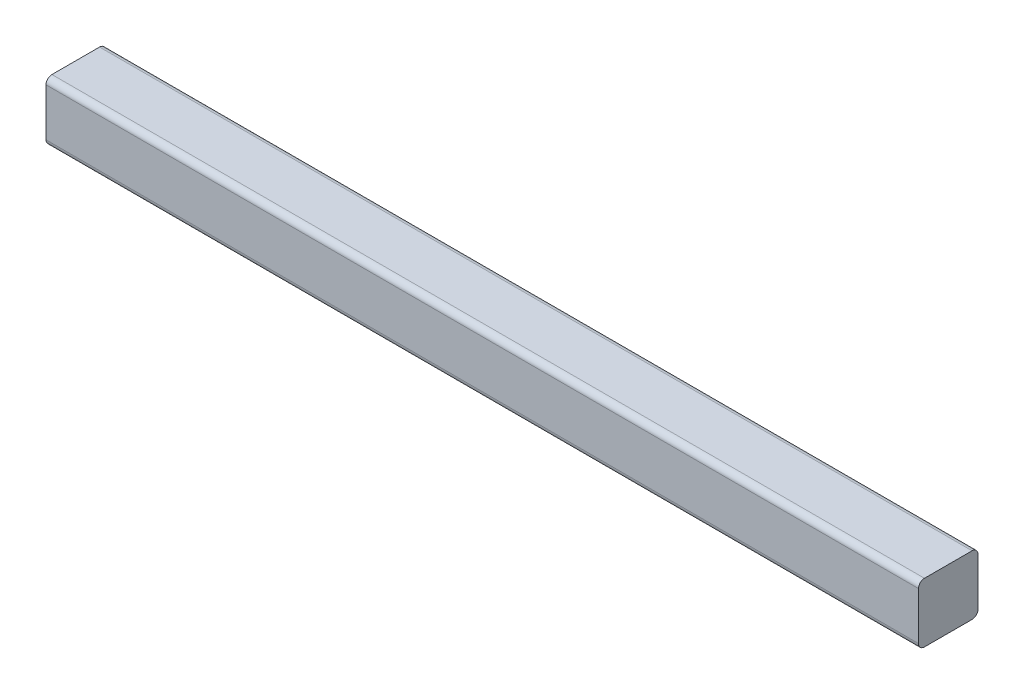
ISO-10303-21;
HEADER;
FILE_DESCRIPTION(('STEP AP214'),'2;1');
FILE_NAME('part.step','',(''),(''),'','','');
FILE_SCHEMA(('AUTOMOTIVE_DESIGN { 1 0 10303 214 1 1 1 1 }'));
ENDSEC;
DATA;
#1=APPLICATION_CONTEXT('core data for automotive mechanical design processes');
#2=APPLICATION_PROTOCOL_DEFINITION('international standard','automotive_design',2000,#1);
#3=PRODUCT_CONTEXT('',#1,'mechanical');
#4=PRODUCT('Part','Part','',(#3));
#5=PRODUCT_RELATED_PRODUCT_CATEGORY('part','',(#4));
#6=PRODUCT_DEFINITION_FORMATION('','',#4);
#7=PRODUCT_DEFINITION_CONTEXT('part definition',#1,'design');
#8=PRODUCT_DEFINITION('design','',#6,#7);
#9=PRODUCT_DEFINITION_SHAPE('','',#8);
#10=(LENGTH_UNIT() NAMED_UNIT(*) SI_UNIT(.MILLI.,.METRE.));
#11=(NAMED_UNIT(*) PLANE_ANGLE_UNIT() SI_UNIT($,.RADIAN.));
#12=(NAMED_UNIT(*) SI_UNIT($,.STERADIAN.) SOLID_ANGLE_UNIT());
#13=UNCERTAINTY_MEASURE_WITH_UNIT(LENGTH_MEASURE(1.E-05),#10,'distance_accuracy_value','');
#14=(GEOMETRIC_REPRESENTATION_CONTEXT(3) GLOBAL_UNCERTAINTY_ASSIGNED_CONTEXT((#13)) GLOBAL_UNIT_ASSIGNED_CONTEXT((#10,
#11,#12)) REPRESENTATION_CONTEXT('',''));
#15=CARTESIAN_POINT('',(0.,0.,0.));
#16=DIRECTION('',(0.,0.,1.));
#17=DIRECTION('',(1.,0.,0.));
#18=AXIS2_PLACEMENT_3D('',#15,#16,#17);
#19=CARTESIAN_POINT('',(-250.019226585785,-40.0000000000074,-702.009684447706));
#20=DIRECTION('',(0.,0.,-1.));
#21=DIRECTION('',(-1.,0.,0.));
#22=AXIS2_PLACEMENT_3D('',#19,#20,#21);
#23=PLANE('',#22);
#24=DIRECTION('',(1.,0.,0.));
#25=VECTOR('',#24,1.);
#26=CARTESIAN_POINT('',(-250.019226585785,-13.0000000000071,-702.009684447706));
#27=LINE('',#26,#25);
#28=CARTESIAN_POINT('',(219.980773427594,-13.000000000019,-702.009684447667));
#29=VERTEX_POINT('',#28);
#30=CARTESIAN_POINT('',(-220.019226585785,-13.0000000000079,-702.009684447703));
#31=VERTEX_POINT('',#30);
#32=EDGE_CURVE('E134',#29,#31,#27,.F.);
#33=ORIENTED_EDGE('',*,*,#32,.F.);
#34=DIRECTION('',(0.,1.,0.));
#35=VECTOR('',#34,1.);
#36=CARTESIAN_POINT('',(219.980773427594,-25.0000000000192,-702.009684447667));
#37=LINE('',#36,#35);
#38=CARTESIAN_POINT('',(219.980773427594,-37.0000000000193,-702.009684447667));
#39=VERTEX_POINT('',#38);
#40=EDGE_CURVE('E92',#39,#29,#37,.T.);
#41=ORIENTED_EDGE('',*,*,#40,.F.);
#42=DIRECTION('',(1.,0.,0.));
#43=VECTOR('',#42,1.);
#44=CARTESIAN_POINT('',(-250.019226585785,-37.0000000000074,-702.009684447706));
#45=LINE('',#44,#43);
#46=CARTESIAN_POINT('',(-220.019226585786,-37.0000000000082,-702.009684447703));
#47=VERTEX_POINT('',#46);
#48=EDGE_CURVE('E87',#47,#39,#45,.T.);
#49=ORIENTED_EDGE('',*,*,#48,.F.);
#50=DIRECTION('',(0.,1.,0.));
#51=VECTOR('',#50,1.);
#52=CARTESIAN_POINT('',(-220.019226585785,-25.000000000008,-702.009684447703));
#53=LINE('',#52,#51);
#54=EDGE_CURVE('E89',#47,#31,#53,.T.);
#55=ORIENTED_EDGE('',*,*,#54,.T.);
#56=EDGE_LOOP('',(#33,#41,#49,#55));
#57=FACE_BOUND('',#56,.T.);
#58=ADVANCED_FACE('F17',(#57),#23,.T.);
#59=CARTESIAN_POINT('',(-250.019226585785,-13.0000000000071,-699.009684447706));
#60=DIRECTION('',(1.,0.,0.));
#61=DIRECTION('',(0.,0.,-1.));
#62=AXIS2_PLACEMENT_3D('',#59,#60,#61);
#63=CYLINDRICAL_SURFACE('',#62,3.);
#64=CARTESIAN_POINT('',(-220.019226585785,-13.0000000000079,-699.009684447704));
#65=DIRECTION('',(1.,0.,0.));
#66=DIRECTION('',(0.,0.,-1.));
#67=AXIS2_PLACEMENT_3D('',#64,#65,#66);
#68=CIRCLE('',#67,3.);
#69=CARTESIAN_POINT('',(-220.019226585785,-10.0000000000078,-699.009684447685));
#70=VERTEX_POINT('',#69);
#71=EDGE_CURVE('E102',#31,#70,#68,.T.);
#72=ORIENTED_EDGE('',*,*,#71,.T.);
#73=DIRECTION('',(-1.,0.,0.));
#74=VECTOR('',#73,1.);
#75=CARTESIAN_POINT('',(-250.019226585785,-10.0000000000071,-699.009684447667));
#76=LINE('',#75,#74);
#77=CARTESIAN_POINT('',(219.980773427594,-10.000000000019,-699.009684447667));
#78=VERTEX_POINT('',#77);
#79=EDGE_CURVE('E131',#78,#70,#76,.T.);
#80=ORIENTED_EDGE('',*,*,#79,.F.);
#81=CARTESIAN_POINT('',(219.980773427594,-13.000000000019,-699.009684447667));
#82=DIRECTION('',(1.,0.,0.));
#83=DIRECTION('',(0.,0.,-1.));
#84=AXIS2_PLACEMENT_3D('',#81,#82,#83);
#85=CIRCLE('',#84,3.);
#86=EDGE_CURVE('E124',#29,#78,#85,.T.);
#87=ORIENTED_EDGE('',*,*,#86,.F.);
#88=ORIENTED_EDGE('',*,*,#32,.T.);
#89=EDGE_LOOP('',(#72,#80,#87,#88));
#90=FACE_BOUND('',#89,.T.);
#91=ADVANCED_FACE('F149',(#90),#63,.T.);
#92=CARTESIAN_POINT('',(-250.019226585785,-10.0000000000071,-702.009684447706));
#93=DIRECTION('',(0.,1.,0.));
#94=DIRECTION('',(-1.,0.,0.));
#95=AXIS2_PLACEMENT_3D('',#92,#93,#94);
#96=PLANE('',#95);
#97=DIRECTION('',(1.,0.,0.));
#98=VECTOR('',#97,1.);
#99=CARTESIAN_POINT('',(-250.019226585787,-10.0000000000071,-675.009684447706));
#100=LINE('',#99,#98);
#101=CARTESIAN_POINT('',(219.980773427592,-10.000000000019,-675.009684447667));
#102=VERTEX_POINT('',#101);
#103=CARTESIAN_POINT('',(-220.019226585787,-10.0000000000078,-675.009684447704));
#104=VERTEX_POINT('',#103);
#105=EDGE_CURVE('E128',#102,#104,#100,.F.);
#106=ORIENTED_EDGE('',*,*,#105,.F.);
#107=DIRECTION('',(0.,0.,-1.));
#108=VECTOR('',#107,1.);
#109=CARTESIAN_POINT('',(219.980773427577,-10.000000000019,-499.499999999986));
#110=LINE('',#109,#108);
#111=EDGE_CURVE('E121',#78,#102,#110,.F.);
#112=ORIENTED_EDGE('',*,*,#111,.F.);
#113=ORIENTED_EDGE('',*,*,#79,.T.);
#114=DIRECTION('',(0.,0.,-1.));
#115=VECTOR('',#114,1.);
#116=CARTESIAN_POINT('',(-220.019226585802,-10.0000000000078,-499.500000000022));
#117=LINE('',#116,#115);
#118=EDGE_CURVE('E105',#70,#104,#117,.F.);
#119=ORIENTED_EDGE('',*,*,#118,.T.);
#120=EDGE_LOOP('',(#106,#112,#113,#119));
#121=FACE_BOUND('',#120,.T.);
#122=ADVANCED_FACE('F151',(#121),#96,.T.);
#123=CARTESIAN_POINT('',(-250.019226585787,-13.0000000000071,-675.009684447706));
#124=DIRECTION('',(1.,0.,0.));
#125=DIRECTION('',(0.,0.,-1.));
#126=AXIS2_PLACEMENT_3D('',#123,#124,#125);
#127=CYLINDRICAL_SURFACE('',#126,3.);
#128=CARTESIAN_POINT('',(-220.019226585787,-13.0000000000079,-675.009684447704));
#129=DIRECTION('',(1.,0.,0.));
#130=DIRECTION('',(0.,0.,-1.));
#131=AXIS2_PLACEMENT_3D('',#128,#129,#130);
#132=CIRCLE('',#131,3.);
#133=CARTESIAN_POINT('',(-220.019226585787,-13.0000000000134,-672.009684447703));
#134=VERTEX_POINT('',#133);
#135=EDGE_CURVE('E138',#104,#134,#132,.T.);
#136=ORIENTED_EDGE('',*,*,#135,.T.);
#137=DIRECTION('',(1.,0.,0.));
#138=VECTOR('',#137,1.);
#139=CARTESIAN_POINT('',(-250.019226585787,-13.000000000019,-672.009684447706));
#140=LINE('',#139,#138);
#141=CARTESIAN_POINT('',(219.980773427592,-13.000000000019,-672.009684447667));
#142=VERTEX_POINT('',#141);
#143=EDGE_CURVE('E93',#142,#134,#140,.F.);
#144=ORIENTED_EDGE('',*,*,#143,.F.);
#145=CARTESIAN_POINT('',(219.980773427592,-13.000000000019,-675.009684447667));
#146=DIRECTION('',(1.,0.,0.));
#147=DIRECTION('',(0.,0.,-1.));
#148=AXIS2_PLACEMENT_3D('',#145,#146,#147);
#149=CIRCLE('',#148,3.);
#150=EDGE_CURVE('E120',#102,#142,#149,.T.);
#151=ORIENTED_EDGE('',*,*,#150,.F.);
#152=ORIENTED_EDGE('',*,*,#105,.T.);
#153=EDGE_LOOP('',(#136,#144,#151,#152));
#154=FACE_BOUND('',#153,.T.);
#155=ADVANCED_FACE('F155',(#154),#127,.T.);
#156=CARTESIAN_POINT('',(-250.019226585787,-10.0000000000071,-672.009684447706));
#157=DIRECTION('',(0.,0.,1.));
#158=DIRECTION('',(1.,0.,0.));
#159=AXIS2_PLACEMENT_3D('',#156,#157,#158);
#160=PLANE('',#159);
#161=DIRECTION('',(1.,0.,0.));
#162=VECTOR('',#161,1.);
#163=CARTESIAN_POINT('',(-250.019226585787,-37.0000000000074,-672.009684447706));
#164=LINE('',#163,#162);
#165=CARTESIAN_POINT('',(219.980773427591,-37.0000000000193,-672.009684447667));
#166=VERTEX_POINT('',#165);
#167=CARTESIAN_POINT('',(-220.019226585788,-37.0000000000081,-672.009684447703));
#168=VERTEX_POINT('',#167);
#169=EDGE_CURVE('E103',#166,#168,#164,.F.);
#170=ORIENTED_EDGE('',*,*,#169,.F.);
#171=DIRECTION('',(0.,1.,0.));
#172=VECTOR('',#171,1.);
#173=CARTESIAN_POINT('',(219.980773427591,-25.0000000000192,-672.009684447667));
#174=LINE('',#173,#172);
#175=EDGE_CURVE('E118',#142,#166,#174,.F.);
#176=ORIENTED_EDGE('',*,*,#175,.F.);
#177=ORIENTED_EDGE('',*,*,#143,.T.);
#178=DIRECTION('',(0.,1.,0.));
#179=VECTOR('',#178,1.);
#180=CARTESIAN_POINT('',(-220.019226585788,-25.000000000008,-672.009684447703));
#181=LINE('',#180,#179);
#182=EDGE_CURVE('E137',#134,#168,#181,.F.);
#183=ORIENTED_EDGE('',*,*,#182,.T.);
#184=EDGE_LOOP('',(#170,#176,#177,#183));
#185=FACE_BOUND('',#184,.T.);
#186=ADVANCED_FACE('F159',(#185),#160,.T.);
#187=CARTESIAN_POINT('',(-250.019226585785,-37.0000000000074,-699.009684447706));
#188=DIRECTION('',(1.,0.,0.));
#189=DIRECTION('',(0.,0.,-1.));
#190=AXIS2_PLACEMENT_3D('',#187,#188,#189);
#191=CYLINDRICAL_SURFACE('',#190,3.);
#192=CARTESIAN_POINT('',(-220.019226585786,-37.0000000000082,-699.009684447704));
#193=DIRECTION('',(1.,0.,0.));
#194=DIRECTION('',(0.,0.,-1.));
#195=AXIS2_PLACEMENT_3D('',#192,#193,#194);
#196=CIRCLE('',#195,3.);
#197=CARTESIAN_POINT('',(-220.019226585786,-40.0000000000082,-699.009684447703));
#198=VERTEX_POINT('',#197);
#199=EDGE_CURVE('E95',#198,#47,#196,.T.);
#200=ORIENTED_EDGE('',*,*,#199,.T.);
#201=ORIENTED_EDGE('',*,*,#48,.T.);
#202=CARTESIAN_POINT('',(219.980773427594,-37.0000000000193,-699.009684447667));
#203=DIRECTION('',(1.,0.,0.));
#204=DIRECTION('',(0.,0.,-1.));
#205=AXIS2_PLACEMENT_3D('',#202,#203,#204);
#206=CIRCLE('',#205,3.);
#207=CARTESIAN_POINT('',(219.980773427593,-40.0000000000193,-699.009684447685));
#208=VERTEX_POINT('',#207);
#209=EDGE_CURVE('E20',#208,#39,#206,.T.);
#210=ORIENTED_EDGE('',*,*,#209,.F.);
#211=DIRECTION('',(1.,0.,0.));
#212=VECTOR('',#211,1.);
#213=CARTESIAN_POINT('',(-250.019226585788,-40.0000000000074,-699.009684447703));
#214=LINE('',#213,#212);
#215=EDGE_CURVE('E81',#198,#208,#214,.T.);
#216=ORIENTED_EDGE('',*,*,#215,.F.);
#217=EDGE_LOOP('',(#200,#201,#210,#216));
#218=FACE_BOUND('',#217,.T.);
#219=ADVANCED_FACE('F96',(#218),#191,.T.);
#220=CARTESIAN_POINT('',(219.980773427577,-25.0000000000192,-499.499999999986));
#221=DIRECTION('',(1.,0.,0.));
#222=DIRECTION('',(0.,0.,-1.));
#223=AXIS2_PLACEMENT_3D('',#220,#221,#222);
#224=PLANE('',#223);
#225=CARTESIAN_POINT('',(219.980773427591,-37.0000000000193,-675.009684447667));
#226=DIRECTION('',(1.,0.,0.));
#227=DIRECTION('',(0.,0.,-1.));
#228=AXIS2_PLACEMENT_3D('',#225,#226,#227);
#229=CIRCLE('',#228,3.);
#230=CARTESIAN_POINT('',(219.980773427592,-40.0000000000193,-675.009684447667));
#231=VERTEX_POINT('',#230);
#232=EDGE_CURVE('E107',#231,#166,#229,.F.);
#233=ORIENTED_EDGE('',*,*,#232,.F.);
#234=DIRECTION('',(0.,0.,1.));
#235=VECTOR('',#234,1.);
#236=CARTESIAN_POINT('',(219.980773427593,-40.0000000000193,-672.009684447706));
#237=LINE('',#236,#235);
#238=EDGE_CURVE('E113',#208,#231,#237,.T.);
#239=ORIENTED_EDGE('',*,*,#238,.F.);
#240=ORIENTED_EDGE('',*,*,#209,.T.);
#241=ORIENTED_EDGE('',*,*,#40,.T.);
#242=ORIENTED_EDGE('',*,*,#86,.T.);
#243=ORIENTED_EDGE('',*,*,#111,.T.);
#244=ORIENTED_EDGE('',*,*,#150,.T.);
#245=ORIENTED_EDGE('',*,*,#175,.T.);
#246=EDGE_LOOP('',(#233,#239,#240,#241,#242,#243,#244,#245));
#247=FACE_BOUND('',#246,.T.);
#248=ADVANCED_FACE('F146',(#247),#224,.T.);
#249=CARTESIAN_POINT('',(-250.019226585787,-37.0000000000074,-675.009684447706));
#250=DIRECTION('',(1.,0.,0.));
#251=DIRECTION('',(0.,0.,-1.));
#252=AXIS2_PLACEMENT_3D('',#249,#250,#251);
#253=CYLINDRICAL_SURFACE('',#252,3.);
#254=CARTESIAN_POINT('',(-220.019226585788,-37.0000000000082,-675.009684447704));
#255=DIRECTION('',(1.,0.,0.));
#256=DIRECTION('',(0.,0.,-1.));
#257=AXIS2_PLACEMENT_3D('',#254,#255,#256);
#258=CIRCLE('',#257,3.);
#259=CARTESIAN_POINT('',(-220.019226585787,-40.0000000000082,-675.009684447685));
#260=VERTEX_POINT('',#259);
#261=EDGE_CURVE('E35',#168,#260,#258,.T.);
#262=ORIENTED_EDGE('',*,*,#261,.T.);
#263=DIRECTION('',(1.,0.,0.));
#264=VECTOR('',#263,1.);
#265=CARTESIAN_POINT('',(-250.019226585788,-40.0000000000074,-675.009684447667));
#266=LINE('',#265,#264);
#267=EDGE_CURVE('E26',#231,#260,#266,.F.);
#268=ORIENTED_EDGE('',*,*,#267,.F.);
#269=ORIENTED_EDGE('',*,*,#232,.T.);
#270=ORIENTED_EDGE('',*,*,#169,.T.);
#271=EDGE_LOOP('',(#262,#268,#269,#270));
#272=FACE_BOUND('',#271,.T.);
#273=ADVANCED_FACE('F161',(#272),#253,.T.);
#274=CARTESIAN_POINT('',(-220.019226585802,-25.000000000008,-499.500000000022));
#275=DIRECTION('',(1.,0.,0.));
#276=DIRECTION('',(0.,0.,-1.));
#277=AXIS2_PLACEMENT_3D('',#274,#275,#276);
#278=PLANE('',#277);
#279=DIRECTION('',(0.,0.,1.));
#280=VECTOR('',#279,1.);
#281=CARTESIAN_POINT('',(-220.019226585787,-40.0000000000082,-672.009684447706));
#282=LINE('',#281,#280);
#283=EDGE_CURVE('E11',#260,#198,#282,.F.);
#284=ORIENTED_EDGE('',*,*,#283,.F.);
#285=ORIENTED_EDGE('',*,*,#261,.F.);
#286=ORIENTED_EDGE('',*,*,#182,.F.);
#287=ORIENTED_EDGE('',*,*,#135,.F.);
#288=ORIENTED_EDGE('',*,*,#118,.F.);
#289=ORIENTED_EDGE('',*,*,#71,.F.);
#290=ORIENTED_EDGE('',*,*,#54,.F.);
#291=ORIENTED_EDGE('',*,*,#199,.F.);
#292=EDGE_LOOP('',(#284,#285,#286,#287,#288,#289,#290,#291));
#293=FACE_BOUND('',#292,.T.);
#294=ADVANCED_FACE('F100',(#293),#278,.F.);
#295=CARTESIAN_POINT('',(-250.019226585788,-40.0000000000074,-672.009684447706));
#296=DIRECTION('',(0.,-1.,0.));
#297=DIRECTION('',(1.,0.,0.));
#298=AXIS2_PLACEMENT_3D('',#295,#296,#297);
#299=PLANE('',#298);
#300=ORIENTED_EDGE('',*,*,#267,.T.);
#301=ORIENTED_EDGE('',*,*,#283,.T.);
#302=ORIENTED_EDGE('',*,*,#215,.T.);
#303=ORIENTED_EDGE('',*,*,#238,.T.);
#304=EDGE_LOOP('',(#300,#301,#302,#303));
#305=FACE_BOUND('',#304,.T.);
#306=ADVANCED_FACE('F163',(#305),#299,.T.);
#307=CLOSED_SHELL('',(#58,#91,#122,#155,#186,#219,#248,#273,#294,#306));
#308=MANIFOLD_SOLID_BREP('B1',#307);
#309=ADVANCED_BREP_SHAPE_REPRESENTATION('',(#18,#308),#14);
#310=SHAPE_DEFINITION_REPRESENTATION(#9,#309);
ENDSEC;
END-ISO-10303-21;
